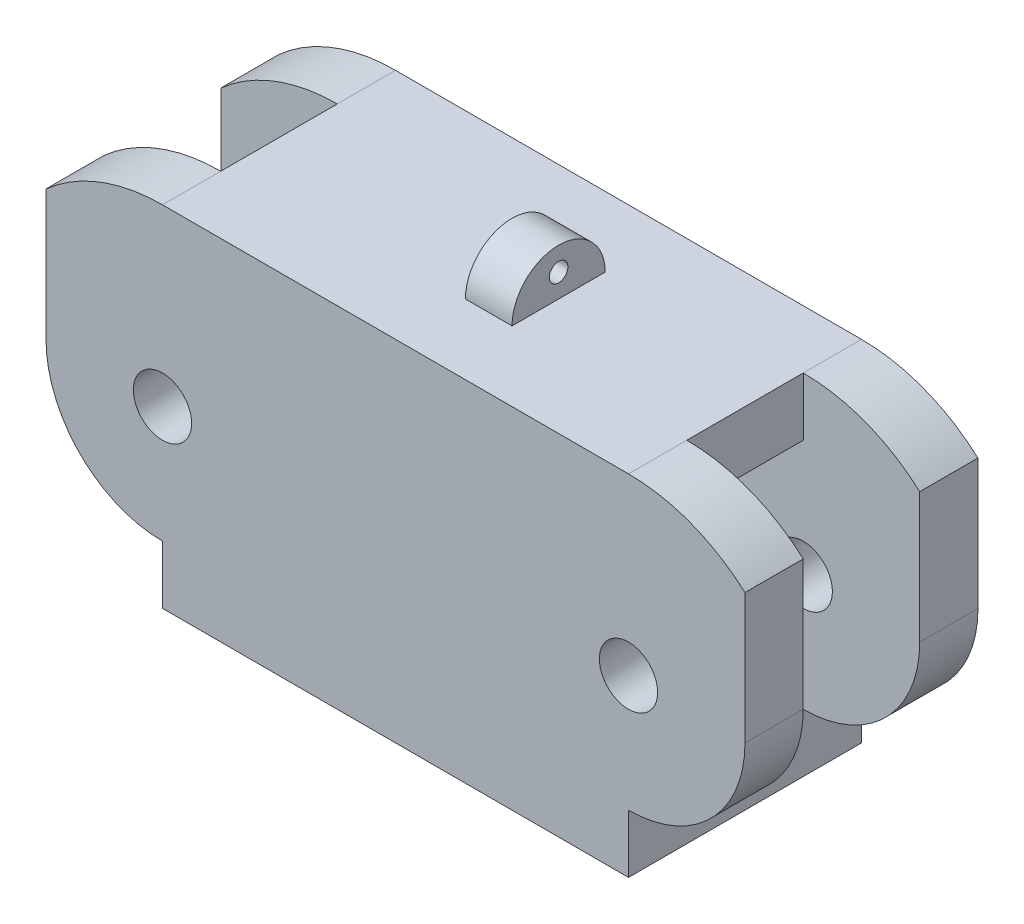
ISO-10303-21;
HEADER;
FILE_DESCRIPTION(('STEP AP214'),'2;1');
FILE_NAME('part.step','',(''),(''),'','','');
FILE_SCHEMA(('AUTOMOTIVE_DESIGN { 1 0 10303 214 1 1 1 1 }'));
ENDSEC;
DATA;
#1=APPLICATION_CONTEXT('core data for automotive mechanical design processes');
#2=APPLICATION_PROTOCOL_DEFINITION('international standard','automotive_design',2000,#1);
#3=PRODUCT_CONTEXT('',#1,'mechanical');
#4=PRODUCT('Part','Part','',(#3));
#5=PRODUCT_RELATED_PRODUCT_CATEGORY('part','',(#4));
#6=PRODUCT_DEFINITION_FORMATION('','',#4);
#7=PRODUCT_DEFINITION_CONTEXT('part definition',#1,'design');
#8=PRODUCT_DEFINITION('design','',#6,#7);
#9=PRODUCT_DEFINITION_SHAPE('','',#8);
#10=(LENGTH_UNIT() NAMED_UNIT(*) SI_UNIT(.MILLI.,.METRE.));
#11=(NAMED_UNIT(*) PLANE_ANGLE_UNIT() SI_UNIT($,.RADIAN.));
#12=(NAMED_UNIT(*) SI_UNIT($,.STERADIAN.) SOLID_ANGLE_UNIT());
#13=UNCERTAINTY_MEASURE_WITH_UNIT(LENGTH_MEASURE(1.E-05),#10,'distance_accuracy_value','');
#14=(GEOMETRIC_REPRESENTATION_CONTEXT(3) GLOBAL_UNCERTAINTY_ASSIGNED_CONTEXT((#13)) GLOBAL_UNIT_ASSIGNED_CONTEXT((#10,
#11,#12)) REPRESENTATION_CONTEXT('',''));
#15=CARTESIAN_POINT('',(0.,0.,0.));
#16=DIRECTION('',(0.,0.,1.));
#17=DIRECTION('',(1.,0.,0.));
#18=AXIS2_PLACEMENT_3D('',#15,#16,#17);
#19=CARTESIAN_POINT('',(-12.7,9.525,-9.525));
#20=DIRECTION('',(0.,0.,1.));
#21=DIRECTION('',(1.,0.,0.));
#22=AXIS2_PLACEMENT_3D('',#19,#20,#21);
#23=CYLINDRICAL_SURFACE('',#22,9.525);
#24=DIRECTION('',(0.,0.,1.));
#25=VECTOR('',#24,1.);
#26=CARTESIAN_POINT('',(-19.05,16.6245158285618,-9.525));
#27=LINE('',#26,#25);
#28=CARTESIAN_POINT('',(-19.05,16.6245158285618,-6.35));
#29=VERTEX_POINT('',#28);
#30=CARTESIAN_POINT('',(-19.05,16.6245158285618,-3.175));
#31=VERTEX_POINT('',#30);
#32=EDGE_CURVE('E275',#29,#31,#27,.T.);
#33=ORIENTED_EDGE('',*,*,#32,.T.);
#34=CARTESIAN_POINT('',(-12.7,9.525,-3.175));
#35=DIRECTION('',(0.,0.,-1.));
#36=DIRECTION('',(-1.,0.,0.));
#37=AXIS2_PLACEMENT_3D('',#34,#35,#36);
#38=CIRCLE('',#37,9.525);
#39=CARTESIAN_POINT('',(-12.7,19.05,-3.175));
#40=VERTEX_POINT('',#39);
#41=EDGE_CURVE('E201',#31,#40,#38,.T.);
#42=ORIENTED_EDGE('',*,*,#41,.T.);
#43=DIRECTION('',(0.,0.,1.));
#44=VECTOR('',#43,1.);
#45=CARTESIAN_POINT('',(-12.7,19.05,-9.525));
#46=LINE('',#45,#44);
#47=CARTESIAN_POINT('',(-12.7,19.05,-6.35));
#48=VERTEX_POINT('',#47);
#49=EDGE_CURVE('E223',#48,#40,#46,.T.);
#50=ORIENTED_EDGE('',*,*,#49,.F.);
#51=CARTESIAN_POINT('',(-12.7,9.525,-6.35));
#52=DIRECTION('',(0.,0.,1.));
#53=DIRECTION('',(1.,0.,0.));
#54=AXIS2_PLACEMENT_3D('',#51,#52,#53);
#55=CIRCLE('',#54,9.525);
#56=EDGE_CURVE('E438',#48,#29,#55,.T.);
#57=ORIENTED_EDGE('',*,*,#56,.T.);
#58=EDGE_LOOP('',(#33,#42,#50,#57));
#59=FACE_BOUND('',#58,.T.);
#60=ADVANCED_FACE('F39',(#59),#23,.T.);
#61=CARTESIAN_POINT('',(-19.05,9.525,-9.525));
#62=DIRECTION('',(1.,0.,0.));
#63=DIRECTION('',(0.,0.,-1.));
#64=AXIS2_PLACEMENT_3D('',#61,#62,#63);
#65=PLANE('',#64);
#66=DIRECTION('',(0.,-1.,0.));
#67=VECTOR('',#66,1.);
#68=CARTESIAN_POINT('',(-19.05,15.875,-3.175));
#69=LINE('',#68,#67);
#70=CARTESIAN_POINT('',(-19.05,9.525,-3.175));
#71=VERTEX_POINT('',#70);
#72=EDGE_CURVE('E285',#31,#71,#69,.T.);
#73=ORIENTED_EDGE('',*,*,#72,.F.);
#74=ORIENTED_EDGE('',*,*,#32,.F.);
#75=DIRECTION('',(0.,1.,0.));
#76=VECTOR('',#75,1.);
#77=CARTESIAN_POINT('',(-19.05,-24.13,-6.35));
#78=LINE('',#77,#76);
#79=CARTESIAN_POINT('',(-19.05,9.525,-6.35));
#80=VERTEX_POINT('',#79);
#81=EDGE_CURVE('E471',#80,#29,#78,.T.);
#82=ORIENTED_EDGE('',*,*,#81,.F.);
#83=DIRECTION('',(0.,0.,1.));
#84=VECTOR('',#83,1.);
#85=CARTESIAN_POINT('',(-19.05,9.525,-9.525));
#86=LINE('',#85,#84);
#87=EDGE_CURVE('E251',#80,#71,#86,.T.);
#88=ORIENTED_EDGE('',*,*,#87,.T.);
#89=EDGE_LOOP('',(#73,#74,#82,#88));
#90=FACE_BOUND('',#89,.T.);
#91=ADVANCED_FACE('F557',(#90),#65,.F.);
#92=CARTESIAN_POINT('',(12.7,9.525,-9.525));
#93=DIRECTION('',(0.,0.,1.));
#94=DIRECTION('',(1.,0.,0.));
#95=AXIS2_PLACEMENT_3D('',#92,#93,#94);
#96=CYLINDRICAL_SURFACE('',#95,9.525);
#97=CARTESIAN_POINT('',(12.7,9.525,-3.175));
#98=DIRECTION('',(0.,0.,-1.));
#99=DIRECTION('',(0.,1.,0.));
#100=AXIS2_PLACEMENT_3D('',#97,#98,#99);
#101=CIRCLE('',#100,9.525);
#102=CARTESIAN_POINT('',(12.7,19.05,-3.175));
#103=VERTEX_POINT('',#102);
#104=CARTESIAN_POINT('',(19.05,16.6245158285618,-3.175));
#105=VERTEX_POINT('',#104);
#106=EDGE_CURVE('E417',#103,#105,#101,.T.);
#107=ORIENTED_EDGE('',*,*,#106,.T.);
#108=DIRECTION('',(0.,0.,1.));
#109=VECTOR('',#108,1.);
#110=CARTESIAN_POINT('',(19.05,16.6245158285618,-9.525));
#111=LINE('',#110,#109);
#112=CARTESIAN_POINT('',(19.05,16.6245158285618,-6.35));
#113=VERTEX_POINT('',#112);
#114=EDGE_CURVE('E288',#105,#113,#111,.F.);
#115=ORIENTED_EDGE('',*,*,#114,.T.);
#116=CARTESIAN_POINT('',(12.7,9.525,-6.35));
#117=DIRECTION('',(0.,0.,1.));
#118=DIRECTION('',(1.,0.,0.));
#119=AXIS2_PLACEMENT_3D('',#116,#117,#118);
#120=CIRCLE('',#119,9.525);
#121=CARTESIAN_POINT('',(12.7,19.05,-6.35));
#122=VERTEX_POINT('',#121);
#123=EDGE_CURVE('E367',#113,#122,#120,.T.);
#124=ORIENTED_EDGE('',*,*,#123,.T.);
#125=DIRECTION('',(0.,0.,1.));
#126=VECTOR('',#125,1.);
#127=CARTESIAN_POINT('',(12.7,19.05,-9.525));
#128=LINE('',#127,#126);
#129=EDGE_CURVE('E441',#122,#103,#128,.T.);
#130=ORIENTED_EDGE('',*,*,#129,.T.);
#131=EDGE_LOOP('',(#107,#115,#124,#130));
#132=FACE_BOUND('',#131,.T.);
#133=ADVANCED_FACE('F527',(#132),#96,.T.);
#134=CARTESIAN_POINT('',(-12.7,9.525,-9.525));
#135=DIRECTION('',(0.,0.,1.));
#136=DIRECTION('',(1.,0.,0.));
#137=AXIS2_PLACEMENT_3D('',#134,#135,#136);
#138=CYLINDRICAL_SURFACE('',#137,1.5875);
#139=CARTESIAN_POINT('',(-12.7,9.525,-6.35));
#140=DIRECTION('',(0.,0.,1.));
#141=DIRECTION('',(1.,0.,0.));
#142=AXIS2_PLACEMENT_3D('',#139,#140,#141);
#143=CIRCLE('',#142,1.5875);
#144=CARTESIAN_POINT('',(-11.1125,9.525,-6.35));
#145=VERTEX_POINT('',#144);
#146=EDGE_CURVE('E374',#145,#145,#143,.F.);
#147=ORIENTED_EDGE('',*,*,#146,.T.);
#148=EDGE_LOOP('',(#147));
#149=FACE_BOUND('',#148,.T.);
#150=CARTESIAN_POINT('',(-12.7,9.525,-3.175));
#151=DIRECTION('',(0.,0.,-1.));
#152=DIRECTION('',(0.,1.,0.));
#153=AXIS2_PLACEMENT_3D('',#150,#151,#152);
#154=CIRCLE('',#153,1.5875);
#155=CARTESIAN_POINT('',(-12.7,11.1125,-3.175));
#156=VERTEX_POINT('',#155);
#157=EDGE_CURVE('E413',#156,#156,#154,.F.);
#158=ORIENTED_EDGE('',*,*,#157,.T.);
#159=EDGE_LOOP('',(#158));
#160=FACE_BOUND('',#159,.T.);
#161=ADVANCED_FACE('F574',(#149,#160),#138,.F.);
#162=CARTESIAN_POINT('',(12.7,9.525,-9.525));
#163=DIRECTION('',(0.,0.,1.));
#164=DIRECTION('',(1.,0.,0.));
#165=AXIS2_PLACEMENT_3D('',#162,#163,#164);
#166=CYLINDRICAL_SURFACE('',#165,1.5875);
#167=CARTESIAN_POINT('',(12.7,9.525,-6.35));
#168=DIRECTION('',(0.,0.,1.));
#169=DIRECTION('',(1.,0.,0.));
#170=AXIS2_PLACEMENT_3D('',#167,#168,#169);
#171=CIRCLE('',#170,1.5875);
#172=CARTESIAN_POINT('',(14.2875,9.525,-6.35));
#173=VERTEX_POINT('',#172);
#174=EDGE_CURVE('E370',#173,#173,#171,.F.);
#175=ORIENTED_EDGE('',*,*,#174,.T.);
#176=EDGE_LOOP('',(#175));
#177=FACE_BOUND('',#176,.T.);
#178=CARTESIAN_POINT('',(12.7,9.525,-3.175));
#179=DIRECTION('',(0.,0.,-1.));
#180=DIRECTION('',(0.,1.,0.));
#181=AXIS2_PLACEMENT_3D('',#178,#179,#180);
#182=CIRCLE('',#181,1.5875);
#183=CARTESIAN_POINT('',(12.7,11.1125,-3.175));
#184=VERTEX_POINT('',#183);
#185=EDGE_CURVE('E412',#184,#184,#182,.F.);
#186=ORIENTED_EDGE('',*,*,#185,.T.);
#187=EDGE_LOOP('',(#186));
#188=FACE_BOUND('',#187,.T.);
#189=ADVANCED_FACE('F583',(#177,#188),#166,.F.);
#190=CARTESIAN_POINT('',(0.,21.59,2.54));
#191=DIRECTION('',(1.,0.,0.));
#192=DIRECTION('',(0.,0.,-1.));
#193=AXIS2_PLACEMENT_3D('',#190,#191,#192);
#194=PLANE('',#193);
#195=DIRECTION('',(0.,0.,1.));
#196=VECTOR('',#195,1.);
#197=CARTESIAN_POINT('',(0.,19.05,2.54));
#198=LINE('',#197,#196);
#199=CARTESIAN_POINT('',(0.,19.05,-2.54));
#200=VERTEX_POINT('',#199);
#201=CARTESIAN_POINT('',(0.,19.05,2.54));
#202=VERTEX_POINT('',#201);
#203=EDGE_CURVE('E421',#200,#202,#198,.T.);
#204=ORIENTED_EDGE('',*,*,#203,.T.);
#205=CARTESIAN_POINT('',(0.,19.05,0.));
#206=DIRECTION('',(1.,0.,0.));
#207=DIRECTION('',(0.,0.,-1.));
#208=AXIS2_PLACEMENT_3D('',#205,#206,#207);
#209=CIRCLE('',#208,2.54);
#210=EDGE_CURVE('E396',#202,#200,#209,.F.);
#211=ORIENTED_EDGE('',*,*,#210,.T.);
#212=EDGE_LOOP('',(#204,#211));
#213=FACE_BOUND('',#212,.T.);
#214=CARTESIAN_POINT('',(0.,20.32,0.));
#215=DIRECTION('',(1.,0.,0.));
#216=DIRECTION('',(0.,0.,-1.));
#217=AXIS2_PLACEMENT_3D('',#214,#215,#216);
#218=CIRCLE('',#217,0.508000000000001);
#219=CARTESIAN_POINT('',(0.,20.32,-0.508000000000001));
#220=VERTEX_POINT('',#219);
#221=EDGE_CURVE('E400',#220,#220,#218,.T.);
#222=ORIENTED_EDGE('',*,*,#221,.T.);
#223=EDGE_LOOP('',(#222));
#224=FACE_BOUND('',#223,.T.);
#225=ADVANCED_FACE('F588',(#213,#224),#194,.F.);
#226=CARTESIAN_POINT('',(2.54,21.59,2.54));
#227=DIRECTION('',(-1.,0.,0.));
#228=DIRECTION('',(0.,0.,1.));
#229=AXIS2_PLACEMENT_3D('',#226,#227,#228);
#230=PLANE('',#229);
#231=DIRECTION('',(0.,0.,-1.));
#232=VECTOR('',#231,1.);
#233=CARTESIAN_POINT('',(2.54,19.05,2.54));
#234=LINE('',#233,#232);
#235=CARTESIAN_POINT('',(2.53999999999999,19.05,2.54));
#236=VERTEX_POINT('',#235);
#237=CARTESIAN_POINT('',(2.54,19.05,-2.54));
#238=VERTEX_POINT('',#237);
#239=EDGE_CURVE('E428',#236,#238,#234,.T.);
#240=ORIENTED_EDGE('',*,*,#239,.T.);
#241=CARTESIAN_POINT('',(2.54,19.05,0.));
#242=DIRECTION('',(-1.,0.,0.));
#243=DIRECTION('',(0.,0.,1.));
#244=AXIS2_PLACEMENT_3D('',#241,#242,#243);
#245=CIRCLE('',#244,2.54);
#246=EDGE_CURVE('E383',#238,#236,#245,.F.);
#247=ORIENTED_EDGE('',*,*,#246,.T.);
#248=EDGE_LOOP('',(#240,#247));
#249=FACE_BOUND('',#248,.T.);
#250=CARTESIAN_POINT('',(2.54,20.32,0.));
#251=DIRECTION('',(-1.,0.,0.));
#252=DIRECTION('',(0.,0.,1.));
#253=AXIS2_PLACEMENT_3D('',#250,#251,#252);
#254=CIRCLE('',#253,0.508000000000001);
#255=CARTESIAN_POINT('',(2.54,20.32,0.508000000000002));
#256=VERTEX_POINT('',#255);
#257=EDGE_CURVE('E399',#256,#256,#254,.T.);
#258=ORIENTED_EDGE('',*,*,#257,.T.);
#259=EDGE_LOOP('',(#258));
#260=FACE_BOUND('',#259,.T.);
#261=ADVANCED_FACE('F592',(#249,#260),#230,.F.);
#262=CARTESIAN_POINT('',(0.,19.05,0.));
#263=DIRECTION('',(0.,1.,0.));
#264=DIRECTION('',(0.,0.,1.));
#265=AXIS2_PLACEMENT_3D('',#262,#263,#264);
#266=PLANE('',#265);
#267=DIRECTION('',(-1.,0.,0.));
#268=VECTOR('',#267,1.);
#269=CARTESIAN_POINT('',(-29.3611541875336,19.05,6.34999999999999));
#270=LINE('',#269,#268);
#271=CARTESIAN_POINT('',(12.7,19.05,6.35000000000001));
#272=VERTEX_POINT('',#271);
#273=CARTESIAN_POINT('',(-12.7,19.05,6.34999999999998));
#274=VERTEX_POINT('',#273);
#275=EDGE_CURVE('E322',#272,#274,#270,.T.);
#276=ORIENTED_EDGE('',*,*,#275,.F.);
#277=CARTESIAN_POINT('',(12.7,19.05,3.175));
#278=VERTEX_POINT('',#277);
#279=EDGE_CURVE('E442',#278,#272,#128,.T.);
#280=ORIENTED_EDGE('',*,*,#279,.F.);
#281=DIRECTION('',(0.,0.,1.));
#282=VECTOR('',#281,1.);
#283=CARTESIAN_POINT('',(12.7,19.05,3.175));
#284=LINE('',#283,#282);
#285=EDGE_CURVE('E321',#103,#278,#284,.T.);
#286=ORIENTED_EDGE('',*,*,#285,.F.);
#287=ORIENTED_EDGE('',*,*,#129,.F.);
#288=DIRECTION('',(1.,0.,0.));
#289=VECTOR('',#288,1.);
#290=CARTESIAN_POINT('',(-12.7,19.05,-6.35));
#291=LINE('',#290,#289);
#292=EDGE_CURVE('E326',#48,#122,#291,.T.);
#293=ORIENTED_EDGE('',*,*,#292,.F.);
#294=ORIENTED_EDGE('',*,*,#49,.T.);
#295=DIRECTION('',(0.,0.,-1.));
#296=VECTOR('',#295,1.);
#297=CARTESIAN_POINT('',(-12.7,19.05,3.175));
#298=LINE('',#297,#296);
#299=CARTESIAN_POINT('',(-12.7,19.05,3.175));
#300=VERTEX_POINT('',#299);
#301=EDGE_CURVE('E208',#300,#40,#298,.T.);
#302=ORIENTED_EDGE('',*,*,#301,.F.);
#303=EDGE_CURVE('E215',#300,#274,#46,.T.);
#304=ORIENTED_EDGE('',*,*,#303,.T.);
#305=EDGE_LOOP('',(#276,#280,#286,#287,#293,#294,#302,#304));
#306=FACE_BOUND('',#305,.T.);
#307=ORIENTED_EDGE('',*,*,#239,.F.);
#308=DIRECTION('',(1.,0.,0.));
#309=VECTOR('',#308,1.);
#310=CARTESIAN_POINT('',(0.,19.05,2.54));
#311=LINE('',#310,#309);
#312=EDGE_CURVE('E425',#202,#236,#311,.T.);
#313=ORIENTED_EDGE('',*,*,#312,.F.);
#314=ORIENTED_EDGE('',*,*,#203,.F.);
#315=DIRECTION('',(-1.,0.,0.));
#316=VECTOR('',#315,1.);
#317=CARTESIAN_POINT('',(0.,19.05,-2.54));
#318=LINE('',#317,#316);
#319=EDGE_CURVE('E432',#238,#200,#318,.T.);
#320=ORIENTED_EDGE('',*,*,#319,.F.);
#321=EDGE_LOOP('',(#307,#313,#314,#320));
#322=FACE_BOUND('',#321,.T.);
#323=ADVANCED_FACE('F227',(#306,#322),#266,.T.);
#324=CARTESIAN_POINT('',(0.,0.,0.));
#325=DIRECTION('',(0.,1.,0.));
#326=DIRECTION('',(0.,0.,1.));
#327=AXIS2_PLACEMENT_3D('',#324,#325,#326);
#328=PLANE('',#327);
#329=DIRECTION('',(0.,0.,1.));
#330=VECTOR('',#329,1.);
#331=CARTESIAN_POINT('',(12.7,0.,-9.525));
#332=LINE('',#331,#330);
#333=CARTESIAN_POINT('',(12.7,0.,-6.35));
#334=VERTEX_POINT('',#333);
#335=CARTESIAN_POINT('',(12.7,0.,6.35000000000001));
#336=VERTEX_POINT('',#335);
#337=EDGE_CURVE('E435',#334,#336,#332,.T.);
#338=ORIENTED_EDGE('',*,*,#337,.T.);
#339=DIRECTION('',(-1.,0.,0.));
#340=VECTOR('',#339,1.);
#341=CARTESIAN_POINT('',(0.,0.,6.35));
#342=LINE('',#341,#340);
#343=CARTESIAN_POINT('',(-12.7,0.,6.34999999999999));
#344=VERTEX_POINT('',#343);
#345=EDGE_CURVE('E355',#336,#344,#342,.T.);
#346=ORIENTED_EDGE('',*,*,#345,.T.);
#347=DIRECTION('',(0.,0.,1.));
#348=VECTOR('',#347,1.);
#349=CARTESIAN_POINT('',(-12.7,0.,-9.525));
#350=LINE('',#349,#348);
#351=CARTESIAN_POINT('',(-12.7,0.,-6.35));
#352=VERTEX_POINT('',#351);
#353=EDGE_CURVE('E224',#352,#344,#350,.T.);
#354=ORIENTED_EDGE('',*,*,#353,.F.);
#355=DIRECTION('',(1.,0.,0.));
#356=VECTOR('',#355,1.);
#357=CARTESIAN_POINT('',(0.,0.,-6.35));
#358=LINE('',#357,#356);
#359=EDGE_CURVE('E363',#352,#334,#358,.T.);
#360=ORIENTED_EDGE('',*,*,#359,.T.);
#361=EDGE_LOOP('',(#338,#346,#354,#360));
#362=FACE_BOUND('',#361,.T.);
#363=ADVANCED_FACE('F41',(#362),#328,.F.);
#364=CARTESIAN_POINT('',(12.7,9.525,6.35000000000001));
#365=DIRECTION('',(0.,0.,-1.));
#366=DIRECTION('',(-1.,0.,0.));
#367=AXIS2_PLACEMENT_3D('',#364,#365,#366);
#368=CIRCLE('',#367,9.525);
#369=CARTESIAN_POINT('',(19.05,16.6245158285618,6.35000000000001));
#370=VERTEX_POINT('',#369);
#371=EDGE_CURVE('E359',#272,#370,#368,.T.);
#372=ORIENTED_EDGE('',*,*,#371,.T.);
#373=DIRECTION('',(0.,0.,1.));
#374=VECTOR('',#373,1.);
#375=CARTESIAN_POINT('',(19.05,16.6245158285618,-9.525));
#376=LINE('',#375,#374);
#377=CARTESIAN_POINT('',(19.05,16.6245158285618,3.17499999999999));
#378=VERTEX_POINT('',#377);
#379=EDGE_CURVE('E63',#370,#378,#376,.F.);
#380=ORIENTED_EDGE('',*,*,#379,.T.);
#381=CARTESIAN_POINT('',(12.7,9.525,3.175));
#382=DIRECTION('',(0.,0.,1.));
#383=DIRECTION('',(0.,-1.,0.));
#384=AXIS2_PLACEMENT_3D('',#381,#382,#383);
#385=CIRCLE('',#384,9.525);
#386=EDGE_CURVE('E409',#378,#278,#385,.T.);
#387=ORIENTED_EDGE('',*,*,#386,.T.);
#388=ORIENTED_EDGE('',*,*,#279,.T.);
#389=EDGE_LOOP('',(#372,#380,#387,#388));
#390=FACE_BOUND('',#389,.T.);
#391=ADVANCED_FACE('F516',(#390),#96,.T.);
#392=ORIENTED_EDGE('',*,*,#303,.F.);
#393=CARTESIAN_POINT('',(-12.7,9.525,3.175));
#394=DIRECTION('',(0.,0.,1.));
#395=DIRECTION('',(1.,0.,0.));
#396=AXIS2_PLACEMENT_3D('',#393,#394,#395);
#397=CIRCLE('',#396,9.525);
#398=CARTESIAN_POINT('',(-19.05,16.6245158285618,3.175));
#399=VERTEX_POINT('',#398);
#400=EDGE_CURVE('E189',#300,#399,#397,.T.);
#401=ORIENTED_EDGE('',*,*,#400,.T.);
#402=CARTESIAN_POINT('',(-19.05,16.6245158285618,6.35));
#403=VERTEX_POINT('',#402);
#404=EDGE_CURVE('E274',#399,#403,#27,.T.);
#405=ORIENTED_EDGE('',*,*,#404,.T.);
#406=CARTESIAN_POINT('',(-12.7,9.525,6.35));
#407=DIRECTION('',(0.,0.,-1.));
#408=DIRECTION('',(-1.,0.,0.));
#409=AXIS2_PLACEMENT_3D('',#406,#407,#408);
#410=CIRCLE('',#409,9.525);
#411=EDGE_CURVE('E218',#403,#274,#410,.T.);
#412=ORIENTED_EDGE('',*,*,#411,.T.);
#413=EDGE_LOOP('',(#392,#401,#405,#412));
#414=FACE_BOUND('',#413,.T.);
#415=ADVANCED_FACE('F216',(#414),#23,.T.);
#416=CARTESIAN_POINT('',(-12.7,9.525,6.35));
#417=DIRECTION('',(0.,0.,-1.));
#418=DIRECTION('',(-1.,0.,0.));
#419=AXIS2_PLACEMENT_3D('',#416,#417,#418);
#420=CIRCLE('',#419,1.5875);
#421=CARTESIAN_POINT('',(-14.2875,9.525,6.35));
#422=VERTEX_POINT('',#421);
#423=EDGE_CURVE('E349',#422,#422,#420,.F.);
#424=ORIENTED_EDGE('',*,*,#423,.T.);
#425=EDGE_LOOP('',(#424));
#426=FACE_BOUND('',#425,.T.);
#427=CARTESIAN_POINT('',(-12.7,9.525,3.175));
#428=DIRECTION('',(0.,0.,1.));
#429=DIRECTION('',(0.,-1.,0.));
#430=AXIS2_PLACEMENT_3D('',#427,#428,#429);
#431=CIRCLE('',#430,1.5875);
#432=CARTESIAN_POINT('',(-12.7,7.9375,3.175));
#433=VERTEX_POINT('',#432);
#434=EDGE_CURVE('E405',#433,#433,#431,.F.);
#435=ORIENTED_EDGE('',*,*,#434,.T.);
#436=EDGE_LOOP('',(#435));
#437=FACE_BOUND('',#436,.T.);
#438=ADVANCED_FACE('F566',(#426,#437),#138,.F.);
#439=CARTESIAN_POINT('',(12.7,9.525,6.35000000000001));
#440=DIRECTION('',(0.,0.,-1.));
#441=DIRECTION('',(-1.,0.,0.));
#442=AXIS2_PLACEMENT_3D('',#439,#440,#441);
#443=CIRCLE('',#442,1.5875);
#444=CARTESIAN_POINT('',(11.1125,9.525,6.35000000000001));
#445=VERTEX_POINT('',#444);
#446=EDGE_CURVE('E348',#445,#445,#443,.F.);
#447=ORIENTED_EDGE('',*,*,#446,.T.);
#448=EDGE_LOOP('',(#447));
#449=FACE_BOUND('',#448,.T.);
#450=CARTESIAN_POINT('',(12.7,9.525,3.175));
#451=DIRECTION('',(0.,0.,1.));
#452=DIRECTION('',(0.,-1.,0.));
#453=AXIS2_PLACEMENT_3D('',#450,#451,#452);
#454=CIRCLE('',#453,1.5875);
#455=CARTESIAN_POINT('',(12.7,7.9375,3.175));
#456=VERTEX_POINT('',#455);
#457=EDGE_CURVE('E404',#456,#456,#454,.F.);
#458=ORIENTED_EDGE('',*,*,#457,.T.);
#459=EDGE_LOOP('',(#458));
#460=FACE_BOUND('',#459,.T.);
#461=ADVANCED_FACE('F571',(#449,#460),#166,.F.);
#462=CARTESIAN_POINT('',(-38.1,19.05,0.));
#463=DIRECTION('',(1.,0.,0.));
#464=DIRECTION('',(0.,0.,-1.));
#465=AXIS2_PLACEMENT_3D('',#462,#463,#464);
#466=CYLINDRICAL_SURFACE('',#465,2.54);
#467=ORIENTED_EDGE('',*,*,#312,.T.);
#468=ORIENTED_EDGE('',*,*,#246,.F.);
#469=ORIENTED_EDGE('',*,*,#319,.T.);
#470=ORIENTED_EDGE('',*,*,#210,.F.);
#471=EDGE_LOOP('',(#467,#468,#469,#470));
#472=FACE_BOUND('',#471,.T.);
#473=ADVANCED_FACE('F605',(#472),#466,.T.);
#474=CARTESIAN_POINT('',(-38.1,20.32,0.));
#475=DIRECTION('',(1.,0.,0.));
#476=DIRECTION('',(0.,0.,-1.));
#477=AXIS2_PLACEMENT_3D('',#474,#475,#476);
#478=CYLINDRICAL_SURFACE('',#477,0.508000000000001);
#479=ORIENTED_EDGE('',*,*,#257,.F.);
#480=EDGE_LOOP('',(#479));
#481=FACE_BOUND('',#480,.T.);
#482=ORIENTED_EDGE('',*,*,#221,.F.);
#483=EDGE_LOOP('',(#482));
#484=FACE_BOUND('',#483,.T.);
#485=ADVANCED_FACE('F612',(#481,#484),#478,.F.);
#486=CARTESIAN_POINT('',(-38.1,3.175,-3.175));
#487=DIRECTION('',(0.,-1.,0.));
#488=DIRECTION('',(0.,0.,-1.));
#489=AXIS2_PLACEMENT_3D('',#486,#487,#488);
#490=PLANE('',#489);
#491=DIRECTION('',(1.,0.,0.));
#492=VECTOR('',#491,1.);
#493=CARTESIAN_POINT('',(-38.1,3.175,-3.175));
#494=LINE('',#493,#492);
#495=CARTESIAN_POINT('',(-12.7,3.175,-3.17500000000001));
#496=VERTEX_POINT('',#495);
#497=CARTESIAN_POINT('',(12.7,3.175,-3.175));
#498=VERTEX_POINT('',#497);
#499=EDGE_CURVE('E379',#496,#498,#494,.T.);
#500=ORIENTED_EDGE('',*,*,#499,.F.);
#501=DIRECTION('',(0.,0.,1.));
#502=VECTOR('',#501,1.);
#503=CARTESIAN_POINT('',(-12.7,3.175,-9.525));
#504=LINE('',#503,#502);
#505=CARTESIAN_POINT('',(-12.7,3.175,3.17499999999999));
#506=VERTEX_POINT('',#505);
#507=EDGE_CURVE('E258',#496,#506,#504,.T.);
#508=ORIENTED_EDGE('',*,*,#507,.T.);
#509=DIRECTION('',(1.,0.,0.));
#510=VECTOR('',#509,1.);
#511=CARTESIAN_POINT('',(-38.1,3.175,3.175));
#512=LINE('',#511,#510);
#513=CARTESIAN_POINT('',(12.7,3.175,3.17499999999999));
#514=VERTEX_POINT('',#513);
#515=EDGE_CURVE('E384',#506,#514,#512,.T.);
#516=ORIENTED_EDGE('',*,*,#515,.T.);
#517=DIRECTION('',(0.,0.,-1.));
#518=VECTOR('',#517,1.);
#519=CARTESIAN_POINT('',(12.7,3.175,-3.175));
#520=LINE('',#519,#518);
#521=EDGE_CURVE('E344',#514,#498,#520,.T.);
#522=ORIENTED_EDGE('',*,*,#521,.T.);
#523=EDGE_LOOP('',(#500,#508,#516,#522));
#524=FACE_BOUND('',#523,.T.);
#525=ADVANCED_FACE('F504',(#524),#490,.F.);
#526=CARTESIAN_POINT('',(-38.1,15.875,-3.175));
#527=DIRECTION('',(0.,1.,0.));
#528=DIRECTION('',(0.,0.,1.));
#529=AXIS2_PLACEMENT_3D('',#526,#527,#528);
#530=PLANE('',#529);
#531=DIRECTION('',(1.,0.,0.));
#532=VECTOR('',#531,1.);
#533=CARTESIAN_POINT('',(-38.1,15.875,3.175));
#534=LINE('',#533,#532);
#535=CARTESIAN_POINT('',(-12.7,15.875,3.175));
#536=VERTEX_POINT('',#535);
#537=CARTESIAN_POINT('',(12.7,15.875,3.175));
#538=VERTEX_POINT('',#537);
#539=EDGE_CURVE('E388',#536,#538,#534,.T.);
#540=ORIENTED_EDGE('',*,*,#539,.F.);
#541=DIRECTION('',(0.,0.,-1.));
#542=VECTOR('',#541,1.);
#543=CARTESIAN_POINT('',(-12.7,15.875,-3.175));
#544=LINE('',#543,#542);
#545=CARTESIAN_POINT('',(-12.7,15.875,-3.175));
#546=VERTEX_POINT('',#545);
#547=EDGE_CURVE('E211',#536,#546,#544,.T.);
#548=ORIENTED_EDGE('',*,*,#547,.T.);
#549=DIRECTION('',(1.,0.,0.));
#550=VECTOR('',#549,1.);
#551=CARTESIAN_POINT('',(-38.1,15.875,-3.175));
#552=LINE('',#551,#550);
#553=CARTESIAN_POINT('',(12.7,15.875,-3.175));
#554=VERTEX_POINT('',#553);
#555=EDGE_CURVE('E378',#546,#554,#552,.T.);
#556=ORIENTED_EDGE('',*,*,#555,.T.);
#557=DIRECTION('',(0.,0.,1.));
#558=VECTOR('',#557,1.);
#559=CARTESIAN_POINT('',(12.7,15.875,-3.175));
#560=LINE('',#559,#558);
#561=EDGE_CURVE('E325',#554,#538,#560,.T.);
#562=ORIENTED_EDGE('',*,*,#561,.T.);
#563=EDGE_LOOP('',(#540,#548,#556,#562));
#564=FACE_BOUND('',#563,.T.);
#565=ADVANCED_FACE('F537',(#564),#530,.F.);
#566=CARTESIAN_POINT('',(-38.1,15.875,-3.175));
#567=DIRECTION('',(0.,0.,-1.));
#568=DIRECTION('',(0.,1.,0.));
#569=AXIS2_PLACEMENT_3D('',#566,#567,#568);
#570=PLANE('',#569);
#571=ORIENTED_EDGE('',*,*,#185,.F.);
#572=EDGE_LOOP('',(#571));
#573=FACE_BOUND('',#572,.T.);
#574=ORIENTED_EDGE('',*,*,#555,.F.);
#575=DIRECTION('',(0.,1.,0.));
#576=VECTOR('',#575,1.);
#577=CARTESIAN_POINT('',(-12.7,15.24,-3.175));
#578=LINE('',#577,#576);
#579=EDGE_CURVE('E202',#546,#40,#578,.T.);
#580=ORIENTED_EDGE('',*,*,#579,.T.);
#581=ORIENTED_EDGE('',*,*,#41,.F.);
#582=ORIENTED_EDGE('',*,*,#72,.T.);
#583=CARTESIAN_POINT('',(-12.7,9.525,-3.175));
#584=DIRECTION('',(0.,0.,-1.));
#585=DIRECTION('',(0.,1.,0.));
#586=AXIS2_PLACEMENT_3D('',#583,#584,#585);
#587=CIRCLE('',#586,6.35);
#588=EDGE_CURVE('E270',#71,#496,#587,.F.);
#589=ORIENTED_EDGE('',*,*,#588,.T.);
#590=ORIENTED_EDGE('',*,*,#499,.T.);
#591=CARTESIAN_POINT('',(12.7,9.525,-3.175));
#592=DIRECTION('',(0.,0.,-1.));
#593=DIRECTION('',(0.,1.,0.));
#594=AXIS2_PLACEMENT_3D('',#591,#592,#593);
#595=CIRCLE('',#594,6.35);
#596=CARTESIAN_POINT('',(19.05,9.525,-3.175));
#597=VERTEX_POINT('',#596);
#598=EDGE_CURVE('E313',#498,#597,#595,.F.);
#599=ORIENTED_EDGE('',*,*,#598,.T.);
#600=DIRECTION('',(0.,1.,0.));
#601=VECTOR('',#600,1.);
#602=CARTESIAN_POINT('',(19.05,15.875,-3.175));
#603=LINE('',#602,#601);
#604=EDGE_CURVE('E292',#597,#105,#603,.T.);
#605=ORIENTED_EDGE('',*,*,#604,.T.);
#606=ORIENTED_EDGE('',*,*,#106,.F.);
#607=DIRECTION('',(0.,1.,0.));
#608=VECTOR('',#607,1.);
#609=CARTESIAN_POINT('',(12.7,-24.13,-3.175));
#610=LINE('',#609,#608);
#611=EDGE_CURVE('E330',#554,#103,#610,.T.);
#612=ORIENTED_EDGE('',*,*,#611,.F.);
#613=EDGE_LOOP('',(#574,#580,#581,#582,#589,#590,#599,#605,#606,#612));
#614=FACE_BOUND('',#613,.T.);
#615=ORIENTED_EDGE('',*,*,#157,.F.);
#616=EDGE_LOOP('',(#615));
#617=FACE_BOUND('',#616,.T.);
#618=ADVANCED_FACE('F532',(#573,#614,#617),#570,.F.);
#619=CARTESIAN_POINT('',(-38.1,15.875,3.175));
#620=DIRECTION('',(0.,0.,1.));
#621=DIRECTION('',(0.,-1.,0.));
#622=AXIS2_PLACEMENT_3D('',#619,#620,#621);
#623=PLANE('',#622);
#624=DIRECTION('',(0.,1.,0.));
#625=VECTOR('',#624,1.);
#626=CARTESIAN_POINT('',(-19.05,15.875,3.175));
#627=LINE('',#626,#625);
#628=CARTESIAN_POINT('',(-19.05,9.525,3.175));
#629=VERTEX_POINT('',#628);
#630=EDGE_CURVE('E196',#629,#399,#627,.T.);
#631=ORIENTED_EDGE('',*,*,#630,.T.);
#632=ORIENTED_EDGE('',*,*,#400,.F.);
#633=DIRECTION('',(0.,1.,0.));
#634=VECTOR('',#633,1.);
#635=CARTESIAN_POINT('',(-12.7,15.24,3.175));
#636=LINE('',#635,#634);
#637=EDGE_CURVE('E193',#536,#300,#636,.T.);
#638=ORIENTED_EDGE('',*,*,#637,.F.);
#639=ORIENTED_EDGE('',*,*,#539,.T.);
#640=DIRECTION('',(0.,1.,0.));
#641=VECTOR('',#640,1.);
#642=CARTESIAN_POINT('',(12.7,-24.13,3.175));
#643=LINE('',#642,#641);
#644=EDGE_CURVE('E334',#538,#278,#643,.T.);
#645=ORIENTED_EDGE('',*,*,#644,.T.);
#646=ORIENTED_EDGE('',*,*,#386,.F.);
#647=DIRECTION('',(0.,-1.,0.));
#648=VECTOR('',#647,1.);
#649=CARTESIAN_POINT('',(19.05,15.875,3.175));
#650=LINE('',#649,#648);
#651=CARTESIAN_POINT('',(19.05,9.525,3.175));
#652=VERTEX_POINT('',#651);
#653=EDGE_CURVE('E301',#378,#652,#650,.T.);
#654=ORIENTED_EDGE('',*,*,#653,.T.);
#655=CARTESIAN_POINT('',(12.7,9.525,3.175));
#656=DIRECTION('',(0.,0.,1.));
#657=DIRECTION('',(0.,-1.,0.));
#658=AXIS2_PLACEMENT_3D('',#655,#656,#657);
#659=CIRCLE('',#658,6.35);
#660=EDGE_CURVE('E309',#652,#514,#659,.F.);
#661=ORIENTED_EDGE('',*,*,#660,.T.);
#662=ORIENTED_EDGE('',*,*,#515,.F.);
#663=CARTESIAN_POINT('',(-12.7,9.525,3.175));
#664=DIRECTION('',(0.,0.,1.));
#665=DIRECTION('',(0.,-1.,0.));
#666=AXIS2_PLACEMENT_3D('',#663,#664,#665);
#667=CIRCLE('',#666,6.35);
#668=EDGE_CURVE('E267',#506,#629,#667,.F.);
#669=ORIENTED_EDGE('',*,*,#668,.T.);
#670=EDGE_LOOP('',(#631,#632,#638,#639,#645,#646,#654,#661,#662,#669));
#671=FACE_BOUND('',#670,.T.);
#672=ORIENTED_EDGE('',*,*,#457,.F.);
#673=EDGE_LOOP('',(#672));
#674=FACE_BOUND('',#673,.T.);
#675=ORIENTED_EDGE('',*,*,#434,.F.);
#676=EDGE_LOOP('',(#675));
#677=FACE_BOUND('',#676,.T.);
#678=ADVANCED_FACE('F191',(#671,#674,#677),#623,.F.);
#679=CARTESIAN_POINT('',(12.7,-24.13,3.175));
#680=DIRECTION('',(-1.,0.,0.));
#681=DIRECTION('',(0.,0.,1.));
#682=AXIS2_PLACEMENT_3D('',#679,#680,#681);
#683=PLANE('',#682);
#684=ORIENTED_EDGE('',*,*,#611,.T.);
#685=ORIENTED_EDGE('',*,*,#285,.T.);
#686=ORIENTED_EDGE('',*,*,#644,.F.);
#687=ORIENTED_EDGE('',*,*,#561,.F.);
#688=EDGE_LOOP('',(#684,#685,#686,#687));
#689=FACE_BOUND('',#688,.T.);
#690=ADVANCED_FACE('F541',(#689),#683,.F.);
#691=DIRECTION('',(0.,1.,0.));
#692=VECTOR('',#691,1.);
#693=CARTESIAN_POINT('',(12.7,-24.13,6.35000000000001));
#694=LINE('',#693,#692);
#695=CARTESIAN_POINT('',(12.7,3.175,6.35));
#696=VERTEX_POINT('',#695);
#697=EDGE_CURVE('E317',#336,#696,#694,.T.);
#698=ORIENTED_EDGE('',*,*,#697,.F.);
#699=ORIENTED_EDGE('',*,*,#337,.F.);
#700=DIRECTION('',(0.,-1.,0.));
#701=VECTOR('',#700,1.);
#702=CARTESIAN_POINT('',(12.7,-24.13,-6.35));
#703=LINE('',#702,#701);
#704=CARTESIAN_POINT('',(12.7,3.175,-6.35));
#705=VERTEX_POINT('',#704);
#706=EDGE_CURVE('E11',#705,#334,#703,.T.);
#707=ORIENTED_EDGE('',*,*,#706,.F.);
#708=DIRECTION('',(0.,0.,1.));
#709=VECTOR('',#708,1.);
#710=CARTESIAN_POINT('',(12.7,3.175,-9.525));
#711=LINE('',#710,#709);
#712=EDGE_CURVE('E245',#705,#498,#711,.T.);
#713=ORIENTED_EDGE('',*,*,#712,.T.);
#714=ORIENTED_EDGE('',*,*,#521,.F.);
#715=EDGE_CURVE('E241',#514,#696,#711,.T.);
#716=ORIENTED_EDGE('',*,*,#715,.T.);
#717=EDGE_LOOP('',(#698,#699,#707,#713,#714,#716));
#718=FACE_BOUND('',#717,.T.);
#719=ADVANCED_FACE('F626',(#718),#683,.F.);
#720=CARTESIAN_POINT('',(-29.3611541875336,-24.13,6.34999999999999));
#721=DIRECTION('',(0.,0.,-1.));
#722=DIRECTION('',(-1.,0.,0.));
#723=AXIS2_PLACEMENT_3D('',#720,#721,#722);
#724=PLANE('',#723);
#725=ORIENTED_EDGE('',*,*,#446,.F.);
#726=EDGE_LOOP('',(#725));
#727=FACE_BOUND('',#726,.T.);
#728=ORIENTED_EDGE('',*,*,#423,.F.);
#729=EDGE_LOOP('',(#728));
#730=FACE_BOUND('',#729,.T.);
#731=ORIENTED_EDGE('',*,*,#345,.F.);
#732=ORIENTED_EDGE('',*,*,#697,.T.);
#733=CARTESIAN_POINT('',(12.7,9.525,6.35000000000001));
#734=DIRECTION('',(0.,0.,-1.));
#735=DIRECTION('',(-1.,0.,0.));
#736=AXIS2_PLACEMENT_3D('',#733,#734,#735);
#737=CIRCLE('',#736,6.35);
#738=CARTESIAN_POINT('',(19.05,9.525,6.35000000000001));
#739=VERTEX_POINT('',#738);
#740=EDGE_CURVE('E305',#696,#739,#737,.F.);
#741=ORIENTED_EDGE('',*,*,#740,.T.);
#742=DIRECTION('',(0.,1.,0.));
#743=VECTOR('',#742,1.);
#744=CARTESIAN_POINT('',(19.05,-24.13,6.35000000000001));
#745=LINE('',#744,#743);
#746=EDGE_CURVE('E296',#739,#370,#745,.T.);
#747=ORIENTED_EDGE('',*,*,#746,.T.);
#748=ORIENTED_EDGE('',*,*,#371,.F.);
#749=ORIENTED_EDGE('',*,*,#275,.T.);
#750=ORIENTED_EDGE('',*,*,#411,.F.);
#751=DIRECTION('',(0.,-1.,0.));
#752=VECTOR('',#751,1.);
#753=CARTESIAN_POINT('',(-19.05,-24.13,6.35));
#754=LINE('',#753,#752);
#755=CARTESIAN_POINT('',(-19.05,9.525,6.34999999999999));
#756=VERTEX_POINT('',#755);
#757=EDGE_CURVE('E279',#403,#756,#754,.T.);
#758=ORIENTED_EDGE('',*,*,#757,.T.);
#759=CARTESIAN_POINT('',(-12.7,9.525,6.35));
#760=DIRECTION('',(0.,0.,-1.));
#761=DIRECTION('',(-1.,0.,0.));
#762=AXIS2_PLACEMENT_3D('',#759,#760,#761);
#763=CIRCLE('',#762,6.35);
#764=CARTESIAN_POINT('',(-12.7,3.175,6.34999999999999));
#765=VERTEX_POINT('',#764);
#766=EDGE_CURVE('E263',#756,#765,#763,.F.);
#767=ORIENTED_EDGE('',*,*,#766,.T.);
#768=DIRECTION('',(0.,-1.,0.));
#769=VECTOR('',#768,1.);
#770=CARTESIAN_POINT('',(-12.7,-24.13,6.35));
#771=LINE('',#770,#769);
#772=EDGE_CURVE('E259',#765,#344,#771,.T.);
#773=ORIENTED_EDGE('',*,*,#772,.T.);
#774=EDGE_LOOP('',(#731,#732,#741,#747,#748,#749,#750,#758,#767,#773));
#775=FACE_BOUND('',#774,.T.);
#776=ADVANCED_FACE('F514',(#727,#730,#775),#724,.F.);
#777=CARTESIAN_POINT('',(-12.7,-24.13,-6.35));
#778=DIRECTION('',(0.,0.,1.));
#779=DIRECTION('',(1.,0.,0.));
#780=AXIS2_PLACEMENT_3D('',#777,#778,#779);
#781=PLANE('',#780);
#782=ORIENTED_EDGE('',*,*,#174,.F.);
#783=EDGE_LOOP('',(#782));
#784=FACE_BOUND('',#783,.T.);
#785=CARTESIAN_POINT('',(12.7,9.525,-6.35));
#786=DIRECTION('',(0.,0.,1.));
#787=DIRECTION('',(1.,0.,0.));
#788=AXIS2_PLACEMENT_3D('',#785,#786,#787);
#789=CIRCLE('',#788,6.35);
#790=CARTESIAN_POINT('',(19.05,9.525,-6.35));
#791=VERTEX_POINT('',#790);
#792=EDGE_CURVE('E48',#791,#705,#789,.F.);
#793=ORIENTED_EDGE('',*,*,#792,.T.);
#794=ORIENTED_EDGE('',*,*,#706,.T.);
#795=ORIENTED_EDGE('',*,*,#359,.F.);
#796=DIRECTION('',(0.,1.,0.));
#797=VECTOR('',#796,1.);
#798=CARTESIAN_POINT('',(-12.7,-24.13,-6.35));
#799=LINE('',#798,#797);
#800=CARTESIAN_POINT('',(-12.7,3.175,-6.35));
#801=VERTEX_POINT('',#800);
#802=EDGE_CURVE('E463',#352,#801,#799,.T.);
#803=ORIENTED_EDGE('',*,*,#802,.T.);
#804=CARTESIAN_POINT('',(-12.7,9.525,-6.35));
#805=DIRECTION('',(0.,0.,1.));
#806=DIRECTION('',(1.,0.,0.));
#807=AXIS2_PLACEMENT_3D('',#804,#805,#806);
#808=CIRCLE('',#807,6.35);
#809=EDGE_CURVE('E467',#801,#80,#808,.F.);
#810=ORIENTED_EDGE('',*,*,#809,.T.);
#811=ORIENTED_EDGE('',*,*,#81,.T.);
#812=ORIENTED_EDGE('',*,*,#56,.F.);
#813=ORIENTED_EDGE('',*,*,#292,.T.);
#814=ORIENTED_EDGE('',*,*,#123,.F.);
#815=DIRECTION('',(0.,-1.,0.));
#816=VECTOR('',#815,1.);
#817=CARTESIAN_POINT('',(19.05,-24.13,-6.35));
#818=LINE('',#817,#816);
#819=EDGE_CURVE('E475',#113,#791,#818,.T.);
#820=ORIENTED_EDGE('',*,*,#819,.T.);
#821=EDGE_LOOP('',(#793,#794,#795,#803,#810,#811,#812,#813,#814,#820));
#822=FACE_BOUND('',#821,.T.);
#823=ORIENTED_EDGE('',*,*,#146,.F.);
#824=EDGE_LOOP('',(#823));
#825=FACE_BOUND('',#824,.T.);
#826=ADVANCED_FACE('F482',(#784,#822,#825),#781,.F.);
#827=ORIENTED_EDGE('',*,*,#404,.F.);
#828=ORIENTED_EDGE('',*,*,#630,.F.);
#829=EDGE_CURVE('E55',#629,#756,#86,.T.);
#830=ORIENTED_EDGE('',*,*,#829,.T.);
#831=ORIENTED_EDGE('',*,*,#757,.F.);
#832=EDGE_LOOP('',(#827,#828,#830,#831));
#833=FACE_BOUND('',#832,.T.);
#834=ADVANCED_FACE('F523',(#833),#65,.F.);
#835=CARTESIAN_POINT('',(-12.7,9.525,-9.525));
#836=DIRECTION('',(0.,0.,1.));
#837=DIRECTION('',(1.,0.,0.));
#838=AXIS2_PLACEMENT_3D('',#835,#836,#837);
#839=CYLINDRICAL_SURFACE('',#838,6.35);
#840=ORIENTED_EDGE('',*,*,#87,.F.);
#841=ORIENTED_EDGE('',*,*,#809,.F.);
#842=EDGE_CURVE('E254',#801,#496,#504,.T.);
#843=ORIENTED_EDGE('',*,*,#842,.T.);
#844=ORIENTED_EDGE('',*,*,#588,.F.);
#845=EDGE_LOOP('',(#840,#841,#843,#844));
#846=FACE_BOUND('',#845,.T.);
#847=ADVANCED_FACE('F670',(#846),#839,.T.);
#848=EDGE_CURVE('E240',#506,#765,#504,.T.);
#849=ORIENTED_EDGE('',*,*,#848,.T.);
#850=ORIENTED_EDGE('',*,*,#766,.F.);
#851=ORIENTED_EDGE('',*,*,#829,.F.);
#852=ORIENTED_EDGE('',*,*,#668,.F.);
#853=EDGE_LOOP('',(#849,#850,#851,#852));
#854=FACE_BOUND('',#853,.T.);
#855=ADVANCED_FACE('F552',(#854),#839,.T.);
#856=CARTESIAN_POINT('',(-12.7,0.,-9.525));
#857=DIRECTION('',(1.,0.,0.));
#858=DIRECTION('',(0.,1.,0.));
#859=AXIS2_PLACEMENT_3D('',#856,#857,#858);
#860=PLANE('',#859);
#861=ORIENTED_EDGE('',*,*,#848,.F.);
#862=ORIENTED_EDGE('',*,*,#507,.F.);
#863=ORIENTED_EDGE('',*,*,#842,.F.);
#864=ORIENTED_EDGE('',*,*,#802,.F.);
#865=ORIENTED_EDGE('',*,*,#353,.T.);
#866=ORIENTED_EDGE('',*,*,#772,.F.);
#867=EDGE_LOOP('',(#861,#862,#863,#864,#865,#866));
#868=FACE_BOUND('',#867,.T.);
#869=ADVANCED_FACE('F545',(#868),#860,.F.);
#870=CARTESIAN_POINT('',(19.05,9.525,-9.525));
#871=DIRECTION('',(-1.,0.,0.));
#872=DIRECTION('',(0.,-1.,0.));
#873=AXIS2_PLACEMENT_3D('',#870,#871,#872);
#874=PLANE('',#873);
#875=DIRECTION('',(0.,0.,1.));
#876=VECTOR('',#875,1.);
#877=CARTESIAN_POINT('',(19.05,9.525,-9.525));
#878=LINE('',#877,#876);
#879=EDGE_CURVE('E246',#791,#597,#878,.T.);
#880=ORIENTED_EDGE('',*,*,#879,.F.);
#881=ORIENTED_EDGE('',*,*,#819,.F.);
#882=ORIENTED_EDGE('',*,*,#114,.F.);
#883=ORIENTED_EDGE('',*,*,#604,.F.);
#884=EDGE_LOOP('',(#880,#881,#882,#883));
#885=FACE_BOUND('',#884,.T.);
#886=ADVANCED_FACE('F543',(#885),#874,.F.);
#887=CARTESIAN_POINT('',(12.7,9.525,-9.525));
#888=DIRECTION('',(0.,0.,1.));
#889=DIRECTION('',(1.,0.,0.));
#890=AXIS2_PLACEMENT_3D('',#887,#888,#889);
#891=CYLINDRICAL_SURFACE('',#890,6.35);
#892=ORIENTED_EDGE('',*,*,#712,.F.);
#893=ORIENTED_EDGE('',*,*,#792,.F.);
#894=ORIENTED_EDGE('',*,*,#879,.T.);
#895=ORIENTED_EDGE('',*,*,#598,.F.);
#896=EDGE_LOOP('',(#892,#893,#894,#895));
#897=FACE_BOUND('',#896,.T.);
#898=ADVANCED_FACE('F489',(#897),#891,.T.);
#899=EDGE_CURVE('E247',#652,#739,#878,.T.);
#900=ORIENTED_EDGE('',*,*,#899,.T.);
#901=ORIENTED_EDGE('',*,*,#740,.F.);
#902=ORIENTED_EDGE('',*,*,#715,.F.);
#903=ORIENTED_EDGE('',*,*,#660,.F.);
#904=EDGE_LOOP('',(#900,#901,#902,#903));
#905=FACE_BOUND('',#904,.T.);
#906=ADVANCED_FACE('F510',(#905),#891,.T.);
#907=ORIENTED_EDGE('',*,*,#379,.F.);
#908=ORIENTED_EDGE('',*,*,#746,.F.);
#909=ORIENTED_EDGE('',*,*,#899,.F.);
#910=ORIENTED_EDGE('',*,*,#653,.F.);
#911=EDGE_LOOP('',(#907,#908,#909,#910));
#912=FACE_BOUND('',#911,.T.);
#913=ADVANCED_FACE('F511',(#912),#874,.F.);
#914=CARTESIAN_POINT('',(-12.7,15.24,3.175));
#915=DIRECTION('',(1.,0.,0.));
#916=DIRECTION('',(0.,0.,-1.));
#917=AXIS2_PLACEMENT_3D('',#914,#915,#916);
#918=PLANE('',#917);
#919=ORIENTED_EDGE('',*,*,#637,.T.);
#920=ORIENTED_EDGE('',*,*,#301,.T.);
#921=ORIENTED_EDGE('',*,*,#579,.F.);
#922=ORIENTED_EDGE('',*,*,#547,.F.);
#923=EDGE_LOOP('',(#919,#920,#921,#922));
#924=FACE_BOUND('',#923,.T.);
#925=ADVANCED_FACE('F206',(#924),#918,.F.);
#926=CLOSED_SHELL('',(#60,#91,#133,#161,#189,#225,#261,#323,#363,#391,#415,#438,#461,#473,#485,
#525,#565,#618,#678,#690,#719,#776,#826,#834,#847,#855,#869,#886,#898,#906,#913,#925));
#927=MANIFOLD_SOLID_BREP('B2',#926);
#928=ADVANCED_BREP_SHAPE_REPRESENTATION('',(#18,#927),#14);
#929=SHAPE_DEFINITION_REPRESENTATION(#9,#928);
ENDSEC;
END-ISO-10303-21;
